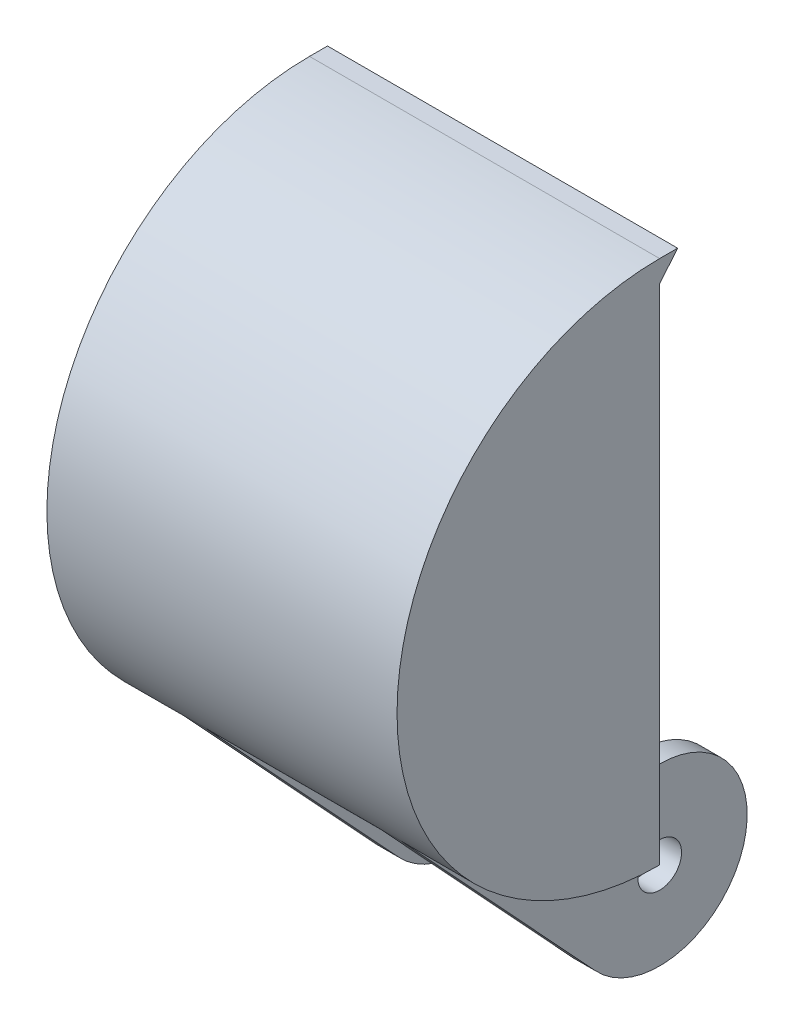
ISO-10303-21;
HEADER;
FILE_DESCRIPTION(('STEP AP214'),'2;1');
FILE_NAME('part.step','',(''),(''),'','','');
FILE_SCHEMA(('AUTOMOTIVE_DESIGN { 1 0 10303 214 1 1 1 1 }'));
ENDSEC;
DATA;
#1=APPLICATION_CONTEXT('core data for automotive mechanical design processes');
#2=APPLICATION_PROTOCOL_DEFINITION('international standard','automotive_design',2000,#1);
#3=PRODUCT_CONTEXT('',#1,'mechanical');
#4=PRODUCT('Part','Part','',(#3));
#5=PRODUCT_RELATED_PRODUCT_CATEGORY('part','',(#4));
#6=PRODUCT_DEFINITION_FORMATION('','',#4);
#7=PRODUCT_DEFINITION_CONTEXT('part definition',#1,'design');
#8=PRODUCT_DEFINITION('design','',#6,#7);
#9=PRODUCT_DEFINITION_SHAPE('','',#8);
#10=(LENGTH_UNIT() NAMED_UNIT(*) SI_UNIT(.MILLI.,.METRE.));
#11=(NAMED_UNIT(*) PLANE_ANGLE_UNIT() SI_UNIT($,.RADIAN.));
#12=(NAMED_UNIT(*) SI_UNIT($,.STERADIAN.) SOLID_ANGLE_UNIT());
#13=UNCERTAINTY_MEASURE_WITH_UNIT(LENGTH_MEASURE(1.E-05),#10,'distance_accuracy_value','');
#14=(GEOMETRIC_REPRESENTATION_CONTEXT(3) GLOBAL_UNCERTAINTY_ASSIGNED_CONTEXT((#13)) GLOBAL_UNIT_ASSIGNED_CONTEXT((#10,
#11,#12)) REPRESENTATION_CONTEXT('',''));
#15=CARTESIAN_POINT('',(0.,0.,0.));
#16=DIRECTION('',(0.,0.,1.));
#17=DIRECTION('',(1.,0.,0.));
#18=AXIS2_PLACEMENT_3D('',#15,#16,#17);
#19=CARTESIAN_POINT('',(25.4,0.,0.));
#20=DIRECTION('',(0.,0.,1.));
#21=DIRECTION('',(1.,0.,0.));
#22=AXIS2_PLACEMENT_3D('',#19,#20,#21);
#23=PLANE('',#22);
#24=DIRECTION('',(0.,1.,0.));
#25=VECTOR('',#24,1.);
#26=CARTESIAN_POINT('',(-25.4,0.,0.));
#27=LINE('',#26,#25);
#28=CARTESIAN_POINT('',(-25.4,0.,0.));
#29=VERTEX_POINT('',#28);
#30=CARTESIAN_POINT('',(-25.4,73.025,0.));
#31=VERTEX_POINT('',#30);
#32=EDGE_CURVE('E225',#29,#31,#27,.T.);
#33=ORIENTED_EDGE('',*,*,#32,.T.);
#34=DIRECTION('',(-1.,0.,0.));
#35=VECTOR('',#34,1.);
#36=CARTESIAN_POINT('',(25.4,73.025,0.));
#37=LINE('',#36,#35);
#38=CARTESIAN_POINT('',(-9.525,73.025,0.));
#39=VERTEX_POINT('',#38);
#40=EDGE_CURVE('E197',#39,#31,#37,.T.);
#41=ORIENTED_EDGE('',*,*,#40,.F.);
#42=CARTESIAN_POINT('',(-9.525,60.325,0.));
#43=DIRECTION('',(0.,0.,1.));
#44=DIRECTION('',(1.,0.,0.));
#45=AXIS2_PLACEMENT_3D('',#42,#43,#44);
#46=CIRCLE('',#45,12.7);
#47=CARTESIAN_POINT('',(-22.225,60.325,0.));
#48=VERTEX_POINT('',#47);
#49=EDGE_CURVE('E188',#39,#48,#46,.T.);
#50=ORIENTED_EDGE('',*,*,#49,.T.);
#51=DIRECTION('',(0.,1.,0.));
#52=VECTOR('',#51,1.);
#53=CARTESIAN_POINT('',(-22.225,0.,0.));
#54=LINE('',#53,#52);
#55=CARTESIAN_POINT('',(-22.225,15.875,0.));
#56=VERTEX_POINT('',#55);
#57=EDGE_CURVE('E182',#56,#48,#54,.T.);
#58=ORIENTED_EDGE('',*,*,#57,.F.);
#59=CARTESIAN_POINT('',(-9.525,15.875,0.));
#60=DIRECTION('',(0.,0.,1.));
#61=DIRECTION('',(0.,-1.,0.));
#62=AXIS2_PLACEMENT_3D('',#59,#60,#61);
#63=CIRCLE('',#62,12.7);
#64=CARTESIAN_POINT('',(-9.525,3.175,0.));
#65=VERTEX_POINT('',#64);
#66=EDGE_CURVE('E186',#56,#65,#63,.T.);
#67=ORIENTED_EDGE('',*,*,#66,.T.);
#68=DIRECTION('',(1.,0.,0.));
#69=VECTOR('',#68,1.);
#70=CARTESIAN_POINT('',(-12.7,3.175,0.));
#71=LINE('',#70,#69);
#72=CARTESIAN_POINT('',(9.5250014844064,3.175,0.));
#73=VERTEX_POINT('',#72);
#74=EDGE_CURVE('E288',#65,#73,#71,.T.);
#75=ORIENTED_EDGE('',*,*,#74,.T.);
#76=CARTESIAN_POINT('',(9.525,15.875,0.));
#77=DIRECTION('',(0.,0.,1.));
#78=DIRECTION('',(1.,0.,0.));
#79=AXIS2_PLACEMENT_3D('',#76,#77,#78);
#80=CIRCLE('',#79,12.7);
#81=CARTESIAN_POINT('',(22.225,15.875,0.));
#82=VERTEX_POINT('',#81);
#83=EDGE_CURVE('E180',#73,#82,#80,.T.);
#84=ORIENTED_EDGE('',*,*,#83,.T.);
#85=DIRECTION('',(0.,1.,0.));
#86=VECTOR('',#85,1.);
#87=CARTESIAN_POINT('',(22.225,0.,0.));
#88=LINE('',#87,#86);
#89=CARTESIAN_POINT('',(22.225,60.325,0.));
#90=VERTEX_POINT('',#89);
#91=EDGE_CURVE('E170',#82,#90,#88,.T.);
#92=ORIENTED_EDGE('',*,*,#91,.T.);
#93=CARTESIAN_POINT('',(9.525,60.325,0.));
#94=DIRECTION('',(0.,0.,1.));
#95=DIRECTION('',(1.,0.,0.));
#96=AXIS2_PLACEMENT_3D('',#93,#94,#95);
#97=CIRCLE('',#96,12.7);
#98=CARTESIAN_POINT('',(9.525,73.025,0.));
#99=VERTEX_POINT('',#98);
#100=EDGE_CURVE('E177',#90,#99,#97,.T.);
#101=ORIENTED_EDGE('',*,*,#100,.T.);
#102=CARTESIAN_POINT('',(25.4,73.025,0.));
#103=VERTEX_POINT('',#102);
#104=EDGE_CURVE('E56',#103,#99,#37,.T.);
#105=ORIENTED_EDGE('',*,*,#104,.F.);
#106=DIRECTION('',(0.,1.,0.));
#107=VECTOR('',#106,1.);
#108=CARTESIAN_POINT('',(25.4,0.,0.));
#109=LINE('',#108,#107);
#110=CARTESIAN_POINT('',(25.4,0.,0.));
#111=VERTEX_POINT('',#110);
#112=EDGE_CURVE('E224',#111,#103,#109,.T.);
#113=ORIENTED_EDGE('',*,*,#112,.F.);
#114=DIRECTION('',(-1.,0.,0.));
#115=VECTOR('',#114,1.);
#116=CARTESIAN_POINT('',(25.4,0.,0.));
#117=LINE('',#116,#115);
#118=CARTESIAN_POINT('',(15.875,0.,0.));
#119=VERTEX_POINT('',#118);
#120=EDGE_CURVE('E218',#111,#119,#117,.T.);
#121=ORIENTED_EDGE('',*,*,#120,.T.);
#122=DIRECTION('',(0.,-1.,0.));
#123=VECTOR('',#122,1.);
#124=CARTESIAN_POINT('',(15.875,3.175,0.));
#125=LINE('',#124,#123);
#126=CARTESIAN_POINT('',(15.875,3.175,0.));
#127=VERTEX_POINT('',#126);
#128=EDGE_CURVE('E247',#127,#119,#125,.T.);
#129=ORIENTED_EDGE('',*,*,#128,.F.);
#130=DIRECTION('',(-1.,0.,0.));
#131=VECTOR('',#130,1.);
#132=CARTESIAN_POINT('',(15.875,3.175,0.));
#133=LINE('',#132,#131);
#134=CARTESIAN_POINT('',(12.7,3.175,0.));
#135=VERTEX_POINT('',#134);
#136=EDGE_CURVE('E48',#127,#135,#133,.T.);
#137=ORIENTED_EDGE('',*,*,#136,.T.);
#138=DIRECTION('',(0.,-1.,0.));
#139=VECTOR('',#138,1.);
#140=CARTESIAN_POINT('',(12.7,3.175,0.));
#141=LINE('',#140,#139);
#142=CARTESIAN_POINT('',(12.7,0.,0.));
#143=VERTEX_POINT('',#142);
#144=EDGE_CURVE('E299',#135,#143,#141,.T.);
#145=ORIENTED_EDGE('',*,*,#144,.T.);
#146=DIRECTION('',(1.,0.,0.));
#147=VECTOR('',#146,1.);
#148=CARTESIAN_POINT('',(-12.7,0.,0.));
#149=LINE('',#148,#147);
#150=CARTESIAN_POINT('',(-12.7,0.,0.));
#151=VERTEX_POINT('',#150);
#152=EDGE_CURVE('E286',#151,#143,#149,.T.);
#153=ORIENTED_EDGE('',*,*,#152,.F.);
#154=DIRECTION('',(0.,-1.,0.));
#155=VECTOR('',#154,1.);
#156=CARTESIAN_POINT('',(-12.7,3.175,0.));
#157=LINE('',#156,#155);
#158=CARTESIAN_POINT('',(-12.7,3.175,0.));
#159=VERTEX_POINT('',#158);
#160=EDGE_CURVE('E295',#159,#151,#157,.T.);
#161=ORIENTED_EDGE('',*,*,#160,.F.);
#162=DIRECTION('',(1.,0.,0.));
#163=VECTOR('',#162,1.);
#164=CARTESIAN_POINT('',(25.4,3.175,0.));
#165=LINE('',#164,#163);
#166=CARTESIAN_POINT('',(-15.875,3.175,0.));
#167=VERTEX_POINT('',#166);
#168=EDGE_CURVE('E11',#167,#159,#165,.T.);
#169=ORIENTED_EDGE('',*,*,#168,.F.);
#170=DIRECTION('',(0.,-1.,0.));
#171=VECTOR('',#170,1.);
#172=CARTESIAN_POINT('',(-15.875,3.175,0.));
#173=LINE('',#172,#171);
#174=CARTESIAN_POINT('',(-15.875,0.,0.));
#175=VERTEX_POINT('',#174);
#176=EDGE_CURVE('E239',#167,#175,#173,.T.);
#177=ORIENTED_EDGE('',*,*,#176,.T.);
#178=EDGE_CURVE('E221',#175,#29,#117,.T.);
#179=ORIENTED_EDGE('',*,*,#178,.T.);
#180=EDGE_LOOP('',(#33,#41,#50,#58,#67,#75,#84,#92,#101,#105,#113,#121,#129,#137,#145,#153,#161,
#169,#177,#179));
#181=FACE_BOUND('',#180,.T.);
#182=ADVANCED_FACE('F39',(#181),#23,.F.);
#183=CARTESIAN_POINT('',(15.875,3.175,0.));
#184=DIRECTION('',(0.,-1.,0.));
#185=DIRECTION('',(0.,0.,-1.));
#186=AXIS2_PLACEMENT_3D('',#183,#184,#185);
#187=PLANE('',#186);
#188=DIRECTION('',(0.,0.,1.));
#189=VECTOR('',#188,1.);
#190=CARTESIAN_POINT('',(-15.875,3.175,0.));
#191=LINE('',#190,#189);
#192=CARTESIAN_POINT('',(-15.875,3.17499999999999,-9.52499999999991));
#193=VERTEX_POINT('',#192);
#194=EDGE_CURVE('E243',#193,#167,#191,.T.);
#195=ORIENTED_EDGE('',*,*,#194,.T.);
#196=ORIENTED_EDGE('',*,*,#168,.T.);
#197=DIRECTION('',(0.,0.,1.));
#198=VECTOR('',#197,1.);
#199=CARTESIAN_POINT('',(-12.7,3.175,0.));
#200=LINE('',#199,#198);
#201=CARTESIAN_POINT('',(-12.7,3.17499999999999,-9.5249999999999));
#202=VERTEX_POINT('',#201);
#203=EDGE_CURVE('E254',#202,#159,#200,.T.);
#204=ORIENTED_EDGE('',*,*,#203,.F.);
#205=DIRECTION('',(-1.,0.,0.));
#206=VECTOR('',#205,1.);
#207=CARTESIAN_POINT('',(15.875,3.17499999999999,-9.5249999999999));
#208=LINE('',#207,#206);
#209=EDGE_CURVE('E238',#202,#193,#208,.T.);
#210=ORIENTED_EDGE('',*,*,#209,.T.);
#211=EDGE_LOOP('',(#195,#196,#204,#210));
#212=FACE_BOUND('',#211,.T.);
#213=ADVANCED_FACE('F337',(#212),#187,.F.);
#214=CARTESIAN_POINT('',(15.875,-9.525,-9.5249999999999));
#215=DIRECTION('',(-1.,0.,0.));
#216=DIRECTION('',(0.,0.,1.));
#217=AXIS2_PLACEMENT_3D('',#214,#215,#216);
#218=CYLINDRICAL_SURFACE('',#217,12.7);
#219=CARTESIAN_POINT('',(-12.7,-9.525,-9.5249999999999));
#220=DIRECTION('',(1.,0.,0.));
#221=DIRECTION('',(0.,0.,-1.));
#222=AXIS2_PLACEMENT_3D('',#219,#220,#221);
#223=CIRCLE('',#222,12.7);
#224=CARTESIAN_POINT('',(-12.7,-18.1607402704121,-0.212965314605844));
#225=VERTEX_POINT('',#224);
#226=EDGE_CURVE('E211',#225,#202,#223,.T.);
#227=ORIENTED_EDGE('',*,*,#226,.F.);
#228=DIRECTION('',(1.,0.,0.));
#229=VECTOR('',#228,1.);
#230=CARTESIAN_POINT('',(-64.2039528206499,-18.1607402704121,-0.212965314605844));
#231=LINE('',#230,#229);
#232=CARTESIAN_POINT('',(-15.875,-18.1607402704121,-0.212965314605844));
#233=VERTEX_POINT('',#232);
#234=EDGE_CURVE('E280',#233,#225,#231,.T.);
#235=ORIENTED_EDGE('',*,*,#234,.F.);
#236=CARTESIAN_POINT('',(-15.875,-9.525,-9.5249999999999));
#237=DIRECTION('',(1.,0.,0.));
#238=DIRECTION('',(0.,0.,-1.));
#239=AXIS2_PLACEMENT_3D('',#236,#237,#238);
#240=CIRCLE('',#239,12.7);
#241=EDGE_CURVE('E252',#233,#193,#240,.T.);
#242=ORIENTED_EDGE('',*,*,#241,.T.);
#243=ORIENTED_EDGE('',*,*,#209,.F.);
#244=EDGE_LOOP('',(#227,#235,#242,#243));
#245=FACE_BOUND('',#244,.T.);
#246=ADVANCED_FACE('F342',(#245),#218,.T.);
#247=CARTESIAN_POINT('',(-64.2039528206499,12.1927791887636,27.9361040561822));
#248=DIRECTION('',(0.,-0.679979548851349,0.733231077590084));
#249=DIRECTION('',(0.,-0.733231077590084,-0.679979548851349));
#250=AXIS2_PLACEMENT_3D('',#247,#248,#249);
#251=PLANE('',#250);
#252=ORIENTED_EDGE('',*,*,#234,.T.);
#253=DIRECTION('',(0.,-0.733231077590084,-0.679979548851349));
#254=VECTOR('',#253,1.);
#255=CARTESIAN_POINT('',(-12.7,12.1927791887636,27.9361040561822));
#256=LINE('',#255,#254);
#257=CARTESIAN_POINT('',(-12.7,12.1927791887636,27.9361040561822));
#258=VERTEX_POINT('',#257);
#259=EDGE_CURVE('E290',#258,#225,#256,.T.);
#260=ORIENTED_EDGE('',*,*,#259,.F.);
#261=DIRECTION('',(1.,0.,0.));
#262=VECTOR('',#261,1.);
#263=CARTESIAN_POINT('',(-64.2039528206499,12.1927791887636,27.9361040561822));
#264=LINE('',#263,#262);
#265=CARTESIAN_POINT('',(-15.875,12.1927791887636,27.9361040561822));
#266=VERTEX_POINT('',#265);
#267=EDGE_CURVE('E275',#266,#258,#264,.T.);
#268=ORIENTED_EDGE('',*,*,#267,.F.);
#269=DIRECTION('',(0.,0.733231077590084,0.679979548851349));
#270=VECTOR('',#269,1.);
#271=CARTESIAN_POINT('',(-15.875,12.1927791887636,27.9361040561822));
#272=LINE('',#271,#270);
#273=EDGE_CURVE('E274',#233,#266,#272,.T.);
#274=ORIENTED_EDGE('',*,*,#273,.F.);
#275=EDGE_LOOP('',(#252,#260,#268,#274));
#276=FACE_BOUND('',#275,.T.);
#277=ADVANCED_FACE('F366',(#276),#251,.T.);
#278=DIRECTION('',(0.,0.,1.));
#279=VECTOR('',#278,1.);
#280=CARTESIAN_POINT('',(12.7,3.175,0.));
#281=LINE('',#280,#279);
#282=CARTESIAN_POINT('',(12.7,3.17499999999999,-9.5249999999999));
#283=VERTEX_POINT('',#282);
#284=EDGE_CURVE('E258',#283,#135,#281,.T.);
#285=ORIENTED_EDGE('',*,*,#284,.T.);
#286=ORIENTED_EDGE('',*,*,#136,.F.);
#287=DIRECTION('',(0.,0.,1.));
#288=VECTOR('',#287,1.);
#289=CARTESIAN_POINT('',(15.875,3.175,0.));
#290=LINE('',#289,#288);
#291=CARTESIAN_POINT('',(15.875,3.17499999999999,-9.5249999999999));
#292=VERTEX_POINT('',#291);
#293=EDGE_CURVE('E242',#292,#127,#290,.T.);
#294=ORIENTED_EDGE('',*,*,#293,.F.);
#295=EDGE_CURVE('E205',#292,#283,#208,.T.);
#296=ORIENTED_EDGE('',*,*,#295,.T.);
#297=EDGE_LOOP('',(#285,#286,#294,#296));
#298=FACE_BOUND('',#297,.T.);
#299=ADVANCED_FACE('F345',(#298),#187,.F.);
#300=CARTESIAN_POINT('',(12.7,-18.1607402704121,-0.212965314605844));
#301=VERTEX_POINT('',#300);
#302=CARTESIAN_POINT('',(15.875,-18.1607402704121,-0.212965314605844));
#303=VERTEX_POINT('',#302);
#304=EDGE_CURVE('E278',#301,#303,#231,.T.);
#305=ORIENTED_EDGE('',*,*,#304,.F.);
#306=CARTESIAN_POINT('',(12.7,-9.525,-9.5249999999999));
#307=DIRECTION('',(1.,0.,0.));
#308=DIRECTION('',(0.,0.,-1.));
#309=AXIS2_PLACEMENT_3D('',#306,#307,#308);
#310=CIRCLE('',#309,12.7);
#311=EDGE_CURVE('E260',#301,#283,#310,.T.);
#312=ORIENTED_EDGE('',*,*,#311,.T.);
#313=ORIENTED_EDGE('',*,*,#295,.F.);
#314=CARTESIAN_POINT('',(15.875,-9.525,-9.5249999999999));
#315=DIRECTION('',(1.,0.,0.));
#316=DIRECTION('',(0.,0.,-1.));
#317=AXIS2_PLACEMENT_3D('',#314,#315,#316);
#318=CIRCLE('',#317,12.7);
#319=EDGE_CURVE('E246',#303,#292,#318,.T.);
#320=ORIENTED_EDGE('',*,*,#319,.F.);
#321=EDGE_LOOP('',(#305,#312,#313,#320));
#322=FACE_BOUND('',#321,.T.);
#323=ADVANCED_FACE('F352',(#322),#218,.T.);
#324=CARTESIAN_POINT('',(25.4,38.1,0.));
#325=DIRECTION('',(-1.,0.,0.));
#326=DIRECTION('',(0.,0.,1.));
#327=AXIS2_PLACEMENT_3D('',#324,#325,#326);
#328=CYLINDRICAL_SURFACE('',#327,38.1);
#329=ORIENTED_EDGE('',*,*,#267,.T.);
#330=CARTESIAN_POINT('',(-12.7,38.1,0.));
#331=DIRECTION('',(-1.,0.,0.));
#332=DIRECTION('',(0.,0.,-1.));
#333=AXIS2_PLACEMENT_3D('',#330,#331,#332);
#334=CIRCLE('',#333,38.1);
#335=EDGE_CURVE('E303',#151,#258,#334,.T.);
#336=ORIENTED_EDGE('',*,*,#335,.F.);
#337=ORIENTED_EDGE('',*,*,#152,.T.);
#338=CARTESIAN_POINT('',(12.7,38.1,0.));
#339=DIRECTION('',(-1.,0.,0.));
#340=DIRECTION('',(0.,0.,-1.));
#341=AXIS2_PLACEMENT_3D('',#338,#339,#340);
#342=CIRCLE('',#341,38.1);
#343=CARTESIAN_POINT('',(12.7,12.1927791887636,27.9361040561822));
#344=VERTEX_POINT('',#343);
#345=EDGE_CURVE('E296',#143,#344,#342,.T.);
#346=ORIENTED_EDGE('',*,*,#345,.T.);
#347=CARTESIAN_POINT('',(15.875,12.1927791887636,27.9361040561822));
#348=VERTEX_POINT('',#347);
#349=EDGE_CURVE('E279',#344,#348,#264,.T.);
#350=ORIENTED_EDGE('',*,*,#349,.T.);
#351=CARTESIAN_POINT('',(15.875,38.1,0.));
#352=DIRECTION('',(1.,0.,0.));
#353=DIRECTION('',(0.,0.,-1.));
#354=AXIS2_PLACEMENT_3D('',#351,#352,#353);
#355=CIRCLE('',#354,38.1);
#356=EDGE_CURVE('E272',#348,#119,#355,.T.);
#357=ORIENTED_EDGE('',*,*,#356,.T.);
#358=ORIENTED_EDGE('',*,*,#120,.F.);
#359=CARTESIAN_POINT('',(25.4,38.1,0.));
#360=DIRECTION('',(1.,0.,0.));
#361=DIRECTION('',(0.,0.,-1.));
#362=AXIS2_PLACEMENT_3D('',#359,#360,#361);
#363=CIRCLE('',#362,38.1);
#364=CARTESIAN_POINT('',(25.4,76.2,0.));
#365=VERTEX_POINT('',#364);
#366=EDGE_CURVE('E227',#365,#111,#363,.T.);
#367=ORIENTED_EDGE('',*,*,#366,.F.);
#368=DIRECTION('',(-1.,0.,0.));
#369=VECTOR('',#368,1.);
#370=CARTESIAN_POINT('',(25.4,76.2,0.));
#371=LINE('',#370,#369);
#372=CARTESIAN_POINT('',(-25.4,76.2,0.));
#373=VERTEX_POINT('',#372);
#374=EDGE_CURVE('E222',#365,#373,#371,.T.);
#375=ORIENTED_EDGE('',*,*,#374,.T.);
#376=CARTESIAN_POINT('',(-25.4,38.1,0.));
#377=DIRECTION('',(1.,0.,0.));
#378=DIRECTION('',(0.,0.,-1.));
#379=AXIS2_PLACEMENT_3D('',#376,#377,#378);
#380=CIRCLE('',#379,38.1);
#381=EDGE_CURVE('E228',#373,#29,#380,.T.);
#382=ORIENTED_EDGE('',*,*,#381,.T.);
#383=ORIENTED_EDGE('',*,*,#178,.F.);
#384=CARTESIAN_POINT('',(-15.875,38.1,0.));
#385=DIRECTION('',(1.,0.,0.));
#386=DIRECTION('',(0.,0.,-1.));
#387=AXIS2_PLACEMENT_3D('',#384,#385,#386);
#388=CIRCLE('',#387,38.1);
#389=EDGE_CURVE('E270',#266,#175,#388,.T.);
#390=ORIENTED_EDGE('',*,*,#389,.F.);
#391=EDGE_LOOP('',(#329,#336,#337,#346,#350,#357,#358,#367,#375,#382,#383,#390));
#392=FACE_BOUND('',#391,.T.);
#393=ADVANCED_FACE('F350',(#392),#328,.T.);
#394=CARTESIAN_POINT('',(25.4,38.1,0.));
#395=DIRECTION('',(1.,0.,0.));
#396=DIRECTION('',(0.,0.,-1.));
#397=AXIS2_PLACEMENT_3D('',#394,#395,#396);
#398=PLANE('',#397);
#399=ORIENTED_EDGE('',*,*,#366,.T.);
#400=ORIENTED_EDGE('',*,*,#112,.T.);
#401=DIRECTION('',(0.,-0.77251181991031,0.635000384329695));
#402=VECTOR('',#401,1.);
#403=CARTESIAN_POINT('',(25.4,76.2,-2.60983219710587));
#404=LINE('',#403,#402);
#405=CARTESIAN_POINT('',(25.4,76.2,-2.60983219710587));
#406=VERTEX_POINT('',#405);
#407=EDGE_CURVE('E308',#406,#103,#404,.T.);
#408=ORIENTED_EDGE('',*,*,#407,.F.);
#409=DIRECTION('',(0.,0.,-1.));
#410=VECTOR('',#409,1.);
#411=CARTESIAN_POINT('',(25.4,76.2,0.));
#412=LINE('',#411,#410);
#413=EDGE_CURVE('E313',#365,#406,#412,.T.);
#414=ORIENTED_EDGE('',*,*,#413,.F.);
#415=EDGE_LOOP('',(#399,#400,#408,#414));
#416=FACE_BOUND('',#415,.T.);
#417=ADVANCED_FACE('F325',(#416),#398,.T.);
#418=CARTESIAN_POINT('',(-25.4,38.1,0.));
#419=DIRECTION('',(1.,0.,0.));
#420=DIRECTION('',(0.,0.,-1.));
#421=AXIS2_PLACEMENT_3D('',#418,#419,#420);
#422=PLANE('',#421);
#423=ORIENTED_EDGE('',*,*,#381,.F.);
#424=DIRECTION('',(0.,0.,-1.));
#425=VECTOR('',#424,1.);
#426=CARTESIAN_POINT('',(-25.4,76.2,0.));
#427=LINE('',#426,#425);
#428=CARTESIAN_POINT('',(-25.4,76.2,-2.60983219710587));
#429=VERTEX_POINT('',#428);
#430=EDGE_CURVE('E314',#373,#429,#427,.T.);
#431=ORIENTED_EDGE('',*,*,#430,.T.);
#432=DIRECTION('',(0.,-0.77251181991031,0.635000384329695));
#433=VECTOR('',#432,1.);
#434=CARTESIAN_POINT('',(-25.4,76.2,-2.60983219710587));
#435=LINE('',#434,#433);
#436=EDGE_CURVE('E310',#429,#31,#435,.T.);
#437=ORIENTED_EDGE('',*,*,#436,.T.);
#438=ORIENTED_EDGE('',*,*,#32,.F.);
#439=EDGE_LOOP('',(#423,#431,#437,#438));
#440=FACE_BOUND('',#439,.T.);
#441=ADVANCED_FACE('F348',(#440),#422,.F.);
#442=CARTESIAN_POINT('',(25.4,38.1,0.));
#443=DIRECTION('',(-1.,0.,0.));
#444=DIRECTION('',(0.,0.,1.));
#445=AXIS2_PLACEMENT_3D('',#442,#443,#444);
#446=CYLINDRICAL_SURFACE('',#445,34.925);
#447=DIRECTION('',(-1.,0.,0.));
#448=VECTOR('',#447,1.);
#449=CARTESIAN_POINT('',(22.225,73.025,0.));
#450=LINE('',#449,#448);
#451=EDGE_CURVE('E181',#99,#39,#450,.T.);
#452=ORIENTED_EDGE('',*,*,#451,.F.);
#453=CARTESIAN_POINT('',(9.525,38.1,0.));
#454=DIRECTION('',(1.,0.,0.));
#455=DIRECTION('',(0.,0.,-1.));
#456=AXIS2_PLACEMENT_3D('',#453,#454,#455);
#457=CIRCLE('',#456,34.925);
#458=EDGE_CURVE('E174',#99,#73,#457,.T.);
#459=ORIENTED_EDGE('',*,*,#458,.T.);
#460=ORIENTED_EDGE('',*,*,#74,.F.);
#461=CARTESIAN_POINT('',(-9.525,38.1,0.));
#462=DIRECTION('',(1.,0.,0.));
#463=DIRECTION('',(0.,0.,-1.));
#464=AXIS2_PLACEMENT_3D('',#461,#462,#463);
#465=CIRCLE('',#464,34.925);
#466=EDGE_CURVE('E209',#65,#39,#465,.F.);
#467=ORIENTED_EDGE('',*,*,#466,.T.);
#468=EDGE_LOOP('',(#452,#459,#460,#467));
#469=FACE_BOUND('',#468,.T.);
#470=ADVANCED_FACE('F385',(#469),#446,.F.);
#471=CARTESIAN_POINT('',(22.225,38.1,0.));
#472=DIRECTION('',(1.,0.,0.));
#473=DIRECTION('',(0.,0.,-1.));
#474=AXIS2_PLACEMENT_3D('',#471,#472,#473);
#475=PLANE('',#474);
#476=ORIENTED_EDGE('',*,*,#91,.F.);
#477=CARTESIAN_POINT('',(22.225,38.1,0.));
#478=DIRECTION('',(1.,0.,0.));
#479=DIRECTION('',(0.,0.,-1.));
#480=AXIS2_PLACEMENT_3D('',#477,#478,#479);
#481=CIRCLE('',#480,22.225);
#482=EDGE_CURVE('E167',#82,#90,#481,.F.);
#483=ORIENTED_EDGE('',*,*,#482,.T.);
#484=EDGE_LOOP('',(#476,#483));
#485=FACE_BOUND('',#484,.T.);
#486=ADVANCED_FACE('F169',(#485),#475,.F.);
#487=CARTESIAN_POINT('',(-22.225,38.1,0.));
#488=DIRECTION('',(1.,0.,0.));
#489=DIRECTION('',(0.,0.,-1.));
#490=AXIS2_PLACEMENT_3D('',#487,#488,#489);
#491=PLANE('',#490);
#492=ORIENTED_EDGE('',*,*,#57,.T.);
#493=CARTESIAN_POINT('',(-22.225,38.1,0.));
#494=DIRECTION('',(1.,0.,0.));
#495=DIRECTION('',(0.,0.,-1.));
#496=AXIS2_PLACEMENT_3D('',#493,#494,#495);
#497=CIRCLE('',#496,22.225);
#498=EDGE_CURVE('E173',#48,#56,#497,.T.);
#499=ORIENTED_EDGE('',*,*,#498,.T.);
#500=EDGE_LOOP('',(#492,#499));
#501=FACE_BOUND('',#500,.T.);
#502=ADVANCED_FACE('F204',(#501),#491,.T.);
#503=CARTESIAN_POINT('',(15.875,-9.525,-9.5249999999999));
#504=DIRECTION('',(1.,0.,0.));
#505=DIRECTION('',(0.,0.,-1.));
#506=AXIS2_PLACEMENT_3D('',#503,#504,#505);
#507=PLANE('',#506);
#508=DIRECTION('',(0.,-0.733231077590084,-0.679979548851349));
#509=VECTOR('',#508,1.);
#510=CARTESIAN_POINT('',(15.875,12.1927791887636,27.9361040561822));
#511=LINE('',#510,#509);
#512=EDGE_CURVE('E283',#348,#303,#511,.T.);
#513=ORIENTED_EDGE('',*,*,#512,.T.);
#514=ORIENTED_EDGE('',*,*,#319,.T.);
#515=ORIENTED_EDGE('',*,*,#293,.T.);
#516=ORIENTED_EDGE('',*,*,#128,.T.);
#517=ORIENTED_EDGE('',*,*,#356,.F.);
#518=EDGE_LOOP('',(#513,#514,#515,#516,#517));
#519=FACE_BOUND('',#518,.T.);
#520=CARTESIAN_POINT('',(15.875,-9.525,-9.5249999999999));
#521=DIRECTION('',(1.,0.,0.));
#522=DIRECTION('',(0.,0.,-1.));
#523=AXIS2_PLACEMENT_3D('',#520,#521,#522);
#524=CIRCLE('',#523,3.175);
#525=CARTESIAN_POINT('',(15.875,-9.525,-12.6999999999999));
#526=VERTEX_POINT('',#525);
#527=EDGE_CURVE('E216',#526,#526,#524,.F.);
#528=ORIENTED_EDGE('',*,*,#527,.T.);
#529=EDGE_LOOP('',(#528));
#530=FACE_BOUND('',#529,.T.);
#531=ADVANCED_FACE('F397',(#519,#530),#507,.T.);
#532=CARTESIAN_POINT('',(-15.875,-9.525,-9.5249999999999));
#533=DIRECTION('',(1.,0.,0.));
#534=DIRECTION('',(0.,0.,-1.));
#535=AXIS2_PLACEMENT_3D('',#532,#533,#534);
#536=PLANE('',#535);
#537=ORIENTED_EDGE('',*,*,#241,.F.);
#538=ORIENTED_EDGE('',*,*,#273,.T.);
#539=ORIENTED_EDGE('',*,*,#389,.T.);
#540=ORIENTED_EDGE('',*,*,#176,.F.);
#541=ORIENTED_EDGE('',*,*,#194,.F.);
#542=EDGE_LOOP('',(#537,#538,#539,#540,#541));
#543=FACE_BOUND('',#542,.T.);
#544=CARTESIAN_POINT('',(-15.875,-9.525,-9.5249999999999));
#545=DIRECTION('',(-1.,0.,0.));
#546=DIRECTION('',(0.,0.,1.));
#547=AXIS2_PLACEMENT_3D('',#544,#545,#546);
#548=CIRCLE('',#547,3.175);
#549=CARTESIAN_POINT('',(-15.875,-9.525,-6.3499999999999));
#550=VERTEX_POINT('',#549);
#551=EDGE_CURVE('E267',#550,#550,#548,.T.);
#552=ORIENTED_EDGE('',*,*,#551,.F.);
#553=EDGE_LOOP('',(#552));
#554=FACE_BOUND('',#553,.T.);
#555=ADVANCED_FACE('F379',(#543,#554),#536,.F.);
#556=CARTESIAN_POINT('',(-12.7,-8.9802561210692,-8.98025612106911));
#557=DIRECTION('',(1.,0.,0.));
#558=DIRECTION('',(0.,0.,-1.));
#559=AXIS2_PLACEMENT_3D('',#556,#557,#558);
#560=PLANE('',#559);
#561=ORIENTED_EDGE('',*,*,#259,.T.);
#562=ORIENTED_EDGE('',*,*,#226,.T.);
#563=ORIENTED_EDGE('',*,*,#203,.T.);
#564=ORIENTED_EDGE('',*,*,#160,.T.);
#565=ORIENTED_EDGE('',*,*,#335,.T.);
#566=EDGE_LOOP('',(#561,#562,#563,#564,#565));
#567=FACE_BOUND('',#566,.T.);
#568=CARTESIAN_POINT('',(-12.7,-9.525,-9.5249999999999));
#569=DIRECTION('',(1.,0.,0.));
#570=DIRECTION('',(0.,0.,-1.));
#571=AXIS2_PLACEMENT_3D('',#568,#569,#570);
#572=CIRCLE('',#571,3.175);
#573=CARTESIAN_POINT('',(-12.7,-9.525,-12.6999999999999));
#574=VERTEX_POINT('',#573);
#575=EDGE_CURVE('E215',#574,#574,#572,.T.);
#576=ORIENTED_EDGE('',*,*,#575,.F.);
#577=EDGE_LOOP('',(#576));
#578=FACE_BOUND('',#577,.T.);
#579=ADVANCED_FACE('F369',(#567,#578),#560,.T.);
#580=CARTESIAN_POINT('',(12.7,-8.9802561210692,-8.98025612106911));
#581=DIRECTION('',(1.,0.,0.));
#582=DIRECTION('',(0.,0.,-1.));
#583=AXIS2_PLACEMENT_3D('',#580,#581,#582);
#584=PLANE('',#583);
#585=ORIENTED_EDGE('',*,*,#311,.F.);
#586=DIRECTION('',(0.,-0.733231077590084,-0.679979548851349));
#587=VECTOR('',#586,1.);
#588=CARTESIAN_POINT('',(12.7,12.1927791887636,27.9361040561822));
#589=LINE('',#588,#587);
#590=EDGE_CURVE('E292',#344,#301,#589,.T.);
#591=ORIENTED_EDGE('',*,*,#590,.F.);
#592=ORIENTED_EDGE('',*,*,#345,.F.);
#593=ORIENTED_EDGE('',*,*,#144,.F.);
#594=ORIENTED_EDGE('',*,*,#284,.F.);
#595=EDGE_LOOP('',(#585,#591,#592,#593,#594));
#596=FACE_BOUND('',#595,.T.);
#597=CARTESIAN_POINT('',(12.7,-9.525,-9.5249999999999));
#598=DIRECTION('',(1.,0.,0.));
#599=DIRECTION('',(0.,0.,-1.));
#600=AXIS2_PLACEMENT_3D('',#597,#598,#599);
#601=CIRCLE('',#600,3.175);
#602=CARTESIAN_POINT('',(12.7,-9.525,-12.6999999999999));
#603=VERTEX_POINT('',#602);
#604=EDGE_CURVE('E212',#603,#603,#601,.T.);
#605=ORIENTED_EDGE('',*,*,#604,.T.);
#606=EDGE_LOOP('',(#605));
#607=FACE_BOUND('',#606,.T.);
#608=ADVANCED_FACE('F410',(#596,#607),#584,.F.);
#609=CARTESIAN_POINT('',(24.8552561210691,-9.525,-9.5249999999999));
#610=DIRECTION('',(-1.,0.,0.));
#611=DIRECTION('',(0.,0.,1.));
#612=AXIS2_PLACEMENT_3D('',#609,#610,#611);
#613=CYLINDRICAL_SURFACE('',#612,3.175);
#614=ORIENTED_EDGE('',*,*,#527,.F.);
#615=EDGE_LOOP('',(#614));
#616=FACE_BOUND('',#615,.T.);
#617=ORIENTED_EDGE('',*,*,#604,.F.);
#618=EDGE_LOOP('',(#617));
#619=FACE_BOUND('',#618,.T.);
#620=ADVANCED_FACE('F413',(#616,#619),#613,.F.);
#621=ORIENTED_EDGE('',*,*,#575,.T.);
#622=EDGE_LOOP('',(#621));
#623=FACE_BOUND('',#622,.T.);
#624=ORIENTED_EDGE('',*,*,#551,.T.);
#625=EDGE_LOOP('',(#624));
#626=FACE_BOUND('',#625,.T.);
#627=ADVANCED_FACE('F415',(#623,#626),#613,.F.);
#628=ORIENTED_EDGE('',*,*,#590,.T.);
#629=ORIENTED_EDGE('',*,*,#304,.T.);
#630=ORIENTED_EDGE('',*,*,#512,.F.);
#631=ORIENTED_EDGE('',*,*,#349,.F.);
#632=EDGE_LOOP('',(#628,#629,#630,#631));
#633=FACE_BOUND('',#632,.T.);
#634=ADVANCED_FACE('F334',(#633),#251,.T.);
#635=CARTESIAN_POINT('',(25.4,76.2,0.));
#636=DIRECTION('',(0.,1.,0.));
#637=DIRECTION('',(0.,0.,1.));
#638=AXIS2_PLACEMENT_3D('',#635,#636,#637);
#639=PLANE('',#638);
#640=ORIENTED_EDGE('',*,*,#430,.F.);
#641=ORIENTED_EDGE('',*,*,#374,.F.);
#642=ORIENTED_EDGE('',*,*,#413,.T.);
#643=DIRECTION('',(-1.,0.,0.));
#644=VECTOR('',#643,1.);
#645=CARTESIAN_POINT('',(25.4,76.2,-2.60983219710587));
#646=LINE('',#645,#644);
#647=EDGE_CURVE('E90',#406,#429,#646,.T.);
#648=ORIENTED_EDGE('',*,*,#647,.T.);
#649=EDGE_LOOP('',(#640,#641,#642,#648));
#650=FACE_BOUND('',#649,.T.);
#651=ADVANCED_FACE('F323',(#650),#639,.T.);
#652=CARTESIAN_POINT('',(25.4,76.2,-2.60983219710587));
#653=DIRECTION('',(0.,-0.635000384329695,-0.77251181991031));
#654=DIRECTION('',(0.,0.772511819910311,-0.635000384329695));
#655=AXIS2_PLACEMENT_3D('',#652,#653,#654);
#656=PLANE('',#655);
#657=ORIENTED_EDGE('',*,*,#436,.F.);
#658=ORIENTED_EDGE('',*,*,#647,.F.);
#659=ORIENTED_EDGE('',*,*,#407,.T.);
#660=ORIENTED_EDGE('',*,*,#104,.T.);
#661=ORIENTED_EDGE('',*,*,#451,.T.);
#662=ORIENTED_EDGE('',*,*,#40,.T.);
#663=EDGE_LOOP('',(#657,#658,#659,#660,#661,#662));
#664=FACE_BOUND('',#663,.T.);
#665=ADVANCED_FACE('F327',(#664),#656,.T.);
#666=CARTESIAN_POINT('',(9.525,38.1,0.));
#667=DIRECTION('',(1.,0.,0.));
#668=DIRECTION('',(0.,0.,-1.));
#669=AXIS2_PLACEMENT_3D('',#666,#667,#668);
#670=TOROIDAL_SURFACE('',#669,22.225,12.7);
#671=ORIENTED_EDGE('',*,*,#100,.F.);
#672=ORIENTED_EDGE('',*,*,#482,.F.);
#673=ORIENTED_EDGE('',*,*,#83,.F.);
#674=ORIENTED_EDGE('',*,*,#458,.F.);
#675=EDGE_LOOP('',(#671,#672,#673,#674));
#676=FACE_BOUND('',#675,.T.);
#677=ADVANCED_FACE('F184',(#676),#670,.F.);
#678=CARTESIAN_POINT('',(-9.525,38.1,0.));
#679=DIRECTION('',(1.,0.,0.));
#680=DIRECTION('',(0.,0.,-1.));
#681=AXIS2_PLACEMENT_3D('',#678,#679,#680);
#682=TOROIDAL_SURFACE('',#681,22.225,12.7);
#683=ORIENTED_EDGE('',*,*,#49,.F.);
#684=ORIENTED_EDGE('',*,*,#466,.F.);
#685=ORIENTED_EDGE('',*,*,#66,.F.);
#686=ORIENTED_EDGE('',*,*,#498,.F.);
#687=EDGE_LOOP('',(#683,#684,#685,#686));
#688=FACE_BOUND('',#687,.T.);
#689=ADVANCED_FACE('F41',(#688),#682,.F.);
#690=CLOSED_SHELL('',(#182,#213,#246,#277,#299,#323,#393,#417,#441,#470,#486,#502,#531,#555,
#579,#608,#620,#627,#634,#651,#665,#677,#689));
#691=MANIFOLD_SOLID_BREP('B2',#690);
#692=ADVANCED_BREP_SHAPE_REPRESENTATION('',(#18,#691),#14);
#693=SHAPE_DEFINITION_REPRESENTATION(#9,#692);
ENDSEC;
END-ISO-10303-21;
